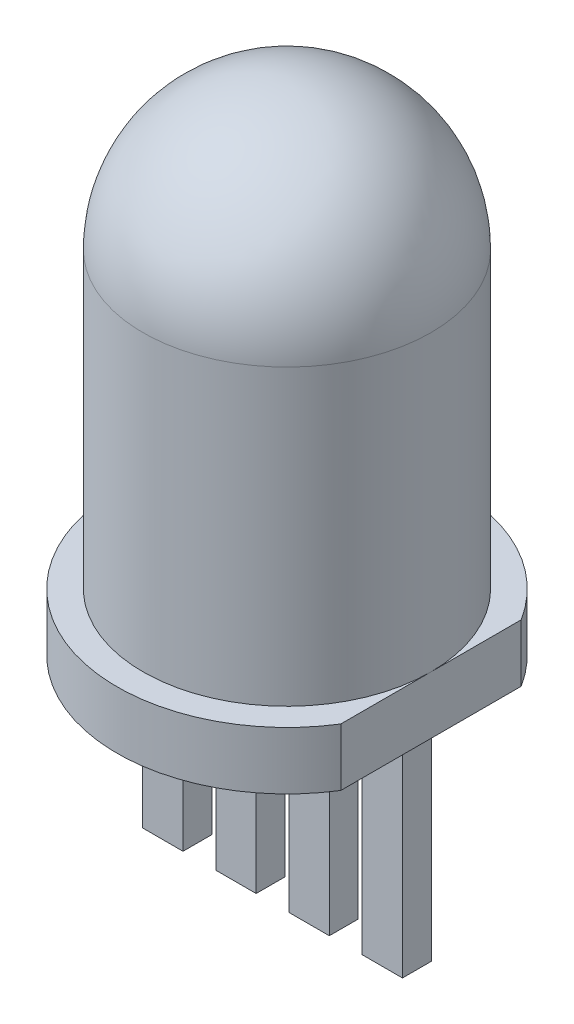
ISO-10303-21;
HEADER;
FILE_DESCRIPTION(('STEP AP214'),'2;1');
FILE_NAME('part.step','',(''),(''),'','','');
FILE_SCHEMA(('AUTOMOTIVE_DESIGN { 1 0 10303 214 1 1 1 1 }'));
ENDSEC;
DATA;
#1=APPLICATION_CONTEXT('core data for automotive mechanical design processes');
#2=APPLICATION_PROTOCOL_DEFINITION('international standard','automotive_design',2000,#1);
#3=PRODUCT_CONTEXT('',#1,'mechanical');
#4=PRODUCT('Part','Part','',(#3));
#5=PRODUCT_RELATED_PRODUCT_CATEGORY('part','',(#4));
#6=PRODUCT_DEFINITION_FORMATION('','',#4);
#7=PRODUCT_DEFINITION_CONTEXT('part definition',#1,'design');
#8=PRODUCT_DEFINITION('design','',#6,#7);
#9=PRODUCT_DEFINITION_SHAPE('','',#8);
#10=(LENGTH_UNIT() NAMED_UNIT(*) SI_UNIT(.MILLI.,.METRE.));
#11=(NAMED_UNIT(*) PLANE_ANGLE_UNIT() SI_UNIT($,.RADIAN.));
#12=(NAMED_UNIT(*) SI_UNIT($,.STERADIAN.) SOLID_ANGLE_UNIT());
#13=UNCERTAINTY_MEASURE_WITH_UNIT(LENGTH_MEASURE(1.E-05),#10,'distance_accuracy_value','');
#14=(GEOMETRIC_REPRESENTATION_CONTEXT(3) GLOBAL_UNCERTAINTY_ASSIGNED_CONTEXT((#13)) GLOBAL_UNIT_ASSIGNED_CONTEXT((#10,
#11,#12)) REPRESENTATION_CONTEXT('',''));
#15=CARTESIAN_POINT('',(0.,0.,0.));
#16=DIRECTION('',(0.,0.,1.));
#17=DIRECTION('',(1.,0.,0.));
#18=AXIS2_PLACEMENT_3D('',#15,#16,#17);
#19=CARTESIAN_POINT('',(0.,0.,0.));
#20=DIRECTION('',(0.,-1.,0.));
#21=DIRECTION('',(0.,0.,-1.));
#22=AXIS2_PLACEMENT_3D('',#19,#20,#21);
#23=CYLINDRICAL_SURFACE('',#22,2.5);
#24=CARTESIAN_POINT('',(0.,1.,0.));
#25=DIRECTION('',(0.,-1.,0.));
#26=DIRECTION('',(0.,0.,-1.));
#27=AXIS2_PLACEMENT_3D('',#24,#25,#26);
#28=CIRCLE('',#27,2.5);
#29=CARTESIAN_POINT('',(2.5,1.,0.));
#30=VERTEX_POINT('',#29);
#31=EDGE_CURVE('E24',#30,#30,#28,.T.);
#32=ORIENTED_EDGE('',*,*,#31,.F.);
#33=EDGE_LOOP('',(#32));
#34=FACE_BOUND('',#33,.T.);
#35=CARTESIAN_POINT('',(0.,6.1,0.));
#36=DIRECTION('',(0.,-1.,0.));
#37=DIRECTION('',(0.,0.,-1.));
#38=AXIS2_PLACEMENT_3D('',#35,#36,#37);
#39=CIRCLE('',#38,2.5);
#40=CARTESIAN_POINT('',(2.5,6.1,0.));
#41=VERTEX_POINT('',#40);
#42=CARTESIAN_POINT('',(-2.5,6.1,0.));
#43=VERTEX_POINT('',#42);
#44=EDGE_CURVE('E301',#41,#43,#39,.T.);
#45=ORIENTED_EDGE('',*,*,#44,.T.);
#46=CARTESIAN_POINT('',(0.,6.1,0.));
#47=DIRECTION('',(0.,-1.,0.));
#48=DIRECTION('',(0.,0.,-1.));
#49=AXIS2_PLACEMENT_3D('',#46,#47,#48);
#50=CIRCLE('',#49,2.5);
#51=EDGE_CURVE('E298',#43,#41,#50,.T.);
#52=ORIENTED_EDGE('',*,*,#51,.T.);
#53=EDGE_LOOP('',(#45,#52));
#54=FACE_BOUND('',#53,.T.);
#55=ADVANCED_FACE('F14',(#34,#54),#23,.T.);
#56=CARTESIAN_POINT('',(0.,6.1,0.));
#57=DIRECTION('',(1.,0.,0.));
#58=DIRECTION('',(0.,1.,0.));
#59=AXIS2_PLACEMENT_3D('',#56,#57,#58);
#60=SPHERICAL_SURFACE('',#59,2.5);
#61=ORIENTED_EDGE('',*,*,#51,.F.);
#62=ORIENTED_EDGE('',*,*,#44,.F.);
#63=EDGE_LOOP('',(#61,#62));
#64=FACE_BOUND('',#63,.T.);
#65=ADVANCED_FACE('F16',(#64),#60,.T.);
#66=CARTESIAN_POINT('',(2.5,1.,1.56604597633658));
#67=DIRECTION('',(-1.,0.,0.));
#68=DIRECTION('',(0.,0.,1.));
#69=AXIS2_PLACEMENT_3D('',#66,#67,#68);
#70=PLANE('',#69);
#71=DIRECTION('',(0.,1.,0.));
#72=VECTOR('',#71,1.);
#73=CARTESIAN_POINT('',(2.5,1.,-1.56604597633658));
#74=LINE('',#73,#72);
#75=CARTESIAN_POINT('',(2.5,1.,-1.56604597633658));
#76=VERTEX_POINT('',#75);
#77=CARTESIAN_POINT('',(2.5,0.,-1.56604597633658));
#78=VERTEX_POINT('',#77);
#79=EDGE_CURVE('E156',#76,#78,#74,.F.);
#80=ORIENTED_EDGE('',*,*,#79,.F.);
#81=CARTESIAN_POINT('',(2.5,1.,-1.56604597633658));
#82=CARTESIAN_POINT('',(2.5,1.,1.56604597633658));
#83=B_SPLINE_CURVE_WITH_KNOTS('',1,(#81,#82),.UNSPECIFIED.,.F.,.F.,(2,2),(0.,1.),.UNSPECIFIED.);
#84=EDGE_CURVE('E9',#76,#30,#83,.T.);
#85=ORIENTED_EDGE('',*,*,#84,.T.);
#86=CARTESIAN_POINT('',(2.5,1.,1.56604597633658));
#87=VERTEX_POINT('',#86);
#88=EDGE_CURVE('E26',#30,#87,#83,.T.);
#89=ORIENTED_EDGE('',*,*,#88,.T.);
#90=DIRECTION('',(0.,1.,0.));
#91=VECTOR('',#90,1.);
#92=CARTESIAN_POINT('',(2.5,1.,1.56604597633658));
#93=LINE('',#92,#91);
#94=CARTESIAN_POINT('',(2.5,0.,1.56604597633658));
#95=VERTEX_POINT('',#94);
#96=EDGE_CURVE('E149',#95,#87,#93,.T.);
#97=ORIENTED_EDGE('',*,*,#96,.F.);
#98=DIRECTION('',(0.,0.,1.));
#99=VECTOR('',#98,1.);
#100=CARTESIAN_POINT('',(2.5,0.,1.56604597633658));
#101=LINE('',#100,#99);
#102=EDGE_CURVE('E152',#78,#95,#101,.T.);
#103=ORIENTED_EDGE('',*,*,#102,.F.);
#104=EDGE_LOOP('',(#80,#85,#89,#97,#103));
#105=FACE_BOUND('',#104,.T.);
#106=ADVANCED_FACE('F151',(#105),#70,.F.);
#107=CARTESIAN_POINT('',(0.,0.,0.));
#108=DIRECTION('',(0.,-1.,0.));
#109=DIRECTION('',(0.,0.,-1.));
#110=AXIS2_PLACEMENT_3D('',#107,#108,#109);
#111=CYLINDRICAL_SURFACE('',#110,2.95);
#112=CARTESIAN_POINT('',(0.,0.,0.));
#113=DIRECTION('',(0.,-1.,0.));
#114=DIRECTION('',(0.,0.,-1.));
#115=AXIS2_PLACEMENT_3D('',#112,#113,#114);
#116=CIRCLE('',#115,2.95);
#117=EDGE_CURVE('E161',#78,#95,#116,.F.);
#118=ORIENTED_EDGE('',*,*,#117,.T.);
#119=ORIENTED_EDGE('',*,*,#96,.T.);
#120=CARTESIAN_POINT('',(0.,1.,0.));
#121=DIRECTION('',(0.,-1.,0.));
#122=DIRECTION('',(0.,0.,-1.));
#123=AXIS2_PLACEMENT_3D('',#120,#121,#122);
#124=CIRCLE('',#123,2.95);
#125=EDGE_CURVE('E19',#87,#76,#124,.T.);
#126=ORIENTED_EDGE('',*,*,#125,.T.);
#127=ORIENTED_EDGE('',*,*,#79,.T.);
#128=EDGE_LOOP('',(#118,#119,#126,#127));
#129=FACE_BOUND('',#128,.T.);
#130=ADVANCED_FACE('F163',(#129),#111,.T.);
#131=CARTESIAN_POINT('',(2.95,0.,0.));
#132=DIRECTION('',(0.,-1.,0.));
#133=DIRECTION('',(0.,0.,-1.));
#134=AXIS2_PLACEMENT_3D('',#131,#132,#133);
#135=PLANE('',#134);
#136=DIRECTION('',(1.,0.,0.));
#137=VECTOR('',#136,1.);
#138=CARTESIAN_POINT('',(2.95,0.,-0.25));
#139=LINE('',#138,#137);
#140=CARTESIAN_POINT('',(2.255,0.,-0.25));
#141=VERTEX_POINT('',#140);
#142=CARTESIAN_POINT('',(1.555,0.,-0.25));
#143=VERTEX_POINT('',#142);
#144=EDGE_CURVE('E164',#141,#143,#139,.F.);
#145=ORIENTED_EDGE('',*,*,#144,.T.);
#146=DIRECTION('',(0.,0.,-1.));
#147=VECTOR('',#146,1.);
#148=CARTESIAN_POINT('',(1.555,0.,0.));
#149=LINE('',#148,#147);
#150=CARTESIAN_POINT('',(1.555,0.,0.25));
#151=VERTEX_POINT('',#150);
#152=EDGE_CURVE('E166',#143,#151,#149,.F.);
#153=ORIENTED_EDGE('',*,*,#152,.T.);
#154=DIRECTION('',(1.,0.,0.));
#155=VECTOR('',#154,1.);
#156=CARTESIAN_POINT('',(2.95,0.,0.25));
#157=LINE('',#156,#155);
#158=CARTESIAN_POINT('',(2.255,0.,0.25));
#159=VERTEX_POINT('',#158);
#160=EDGE_CURVE('E170',#151,#159,#157,.T.);
#161=ORIENTED_EDGE('',*,*,#160,.T.);
#162=DIRECTION('',(0.,0.,-1.));
#163=VECTOR('',#162,1.);
#164=CARTESIAN_POINT('',(2.255,0.,0.));
#165=LINE('',#164,#163);
#166=EDGE_CURVE('E172',#159,#141,#165,.T.);
#167=ORIENTED_EDGE('',*,*,#166,.T.);
#168=EDGE_LOOP('',(#145,#153,#161,#167));
#169=FACE_BOUND('',#168,.T.);
#170=DIRECTION('',(1.,0.,0.));
#171=VECTOR('',#170,1.);
#172=CARTESIAN_POINT('',(2.95,0.,-0.25));
#173=LINE('',#172,#171);
#174=CARTESIAN_POINT('',(-0.284999999999999,0.,-0.25));
#175=VERTEX_POINT('',#174);
#176=CARTESIAN_POINT('',(-0.985,0.,-0.25));
#177=VERTEX_POINT('',#176);
#178=EDGE_CURVE('E175',#175,#177,#173,.F.);
#179=ORIENTED_EDGE('',*,*,#178,.T.);
#180=DIRECTION('',(0.,0.,-1.));
#181=VECTOR('',#180,1.);
#182=CARTESIAN_POINT('',(-0.985,0.,0.));
#183=LINE('',#182,#181);
#184=CARTESIAN_POINT('',(-0.985,0.,0.25));
#185=VERTEX_POINT('',#184);
#186=EDGE_CURVE('E177',#177,#185,#183,.F.);
#187=ORIENTED_EDGE('',*,*,#186,.T.);
#188=DIRECTION('',(1.,0.,0.));
#189=VECTOR('',#188,1.);
#190=CARTESIAN_POINT('',(2.95,0.,0.25));
#191=LINE('',#190,#189);
#192=CARTESIAN_POINT('',(-0.284999999999999,0.,0.25));
#193=VERTEX_POINT('',#192);
#194=EDGE_CURVE('E179',#185,#193,#191,.T.);
#195=ORIENTED_EDGE('',*,*,#194,.T.);
#196=DIRECTION('',(0.,0.,-1.));
#197=VECTOR('',#196,1.);
#198=CARTESIAN_POINT('',(-0.285,0.,0.));
#199=LINE('',#198,#197);
#200=EDGE_CURVE('E181',#193,#175,#199,.T.);
#201=ORIENTED_EDGE('',*,*,#200,.T.);
#202=EDGE_LOOP('',(#179,#187,#195,#201));
#203=FACE_BOUND('',#202,.T.);
#204=ORIENTED_EDGE('',*,*,#117,.F.);
#205=ORIENTED_EDGE('',*,*,#102,.T.);
#206=EDGE_LOOP('',(#204,#205));
#207=FACE_BOUND('',#206,.T.);
#208=DIRECTION('',(1.,0.,0.));
#209=VECTOR('',#208,1.);
#210=CARTESIAN_POINT('',(2.95,0.,-0.25));
#211=LINE('',#210,#209);
#212=CARTESIAN_POINT('',(-1.555,0.,-0.25));
#213=VERTEX_POINT('',#212);
#214=CARTESIAN_POINT('',(-2.255,0.,-0.25));
#215=VERTEX_POINT('',#214);
#216=EDGE_CURVE('E184',#213,#215,#211,.F.);
#217=ORIENTED_EDGE('',*,*,#216,.T.);
#218=DIRECTION('',(0.,0.,-1.));
#219=VECTOR('',#218,1.);
#220=CARTESIAN_POINT('',(-2.255,0.,0.));
#221=LINE('',#220,#219);
#222=CARTESIAN_POINT('',(-2.255,0.,0.25));
#223=VERTEX_POINT('',#222);
#224=EDGE_CURVE('E186',#215,#223,#221,.F.);
#225=ORIENTED_EDGE('',*,*,#224,.T.);
#226=DIRECTION('',(1.,0.,0.));
#227=VECTOR('',#226,1.);
#228=CARTESIAN_POINT('',(2.95,0.,0.25));
#229=LINE('',#228,#227);
#230=CARTESIAN_POINT('',(-1.555,0.,0.25));
#231=VERTEX_POINT('',#230);
#232=EDGE_CURVE('E188',#223,#231,#229,.T.);
#233=ORIENTED_EDGE('',*,*,#232,.T.);
#234=DIRECTION('',(0.,0.,-1.));
#235=VECTOR('',#234,1.);
#236=CARTESIAN_POINT('',(-1.555,0.,0.));
#237=LINE('',#236,#235);
#238=EDGE_CURVE('E190',#231,#213,#237,.T.);
#239=ORIENTED_EDGE('',*,*,#238,.T.);
#240=EDGE_LOOP('',(#217,#225,#233,#239));
#241=FACE_BOUND('',#240,.T.);
#242=DIRECTION('',(1.,0.,0.));
#243=VECTOR('',#242,1.);
#244=CARTESIAN_POINT('',(2.95,0.,-0.25));
#245=LINE('',#244,#243);
#246=CARTESIAN_POINT('',(0.985000000000001,0.,-0.25));
#247=VERTEX_POINT('',#246);
#248=CARTESIAN_POINT('',(0.285000000000001,0.,-0.25));
#249=VERTEX_POINT('',#248);
#250=EDGE_CURVE('E193',#247,#249,#245,.F.);
#251=ORIENTED_EDGE('',*,*,#250,.T.);
#252=DIRECTION('',(0.,0.,-1.));
#253=VECTOR('',#252,1.);
#254=CARTESIAN_POINT('',(0.285000000000001,0.,0.));
#255=LINE('',#254,#253);
#256=CARTESIAN_POINT('',(0.285000000000001,0.,0.25));
#257=VERTEX_POINT('',#256);
#258=EDGE_CURVE('E195',#249,#257,#255,.F.);
#259=ORIENTED_EDGE('',*,*,#258,.T.);
#260=DIRECTION('',(1.,0.,0.));
#261=VECTOR('',#260,1.);
#262=CARTESIAN_POINT('',(2.95,0.,0.25));
#263=LINE('',#262,#261);
#264=CARTESIAN_POINT('',(0.985000000000001,0.,0.25));
#265=VERTEX_POINT('',#264);
#266=EDGE_CURVE('E197',#257,#265,#263,.T.);
#267=ORIENTED_EDGE('',*,*,#266,.T.);
#268=DIRECTION('',(0.,0.,-1.));
#269=VECTOR('',#268,1.);
#270=CARTESIAN_POINT('',(0.985000000000001,0.,0.));
#271=LINE('',#270,#269);
#272=EDGE_CURVE('E199',#265,#247,#271,.T.);
#273=ORIENTED_EDGE('',*,*,#272,.T.);
#274=EDGE_LOOP('',(#251,#259,#267,#273));
#275=FACE_BOUND('',#274,.T.);
#276=ADVANCED_FACE('F159',(#169,#203,#207,#241,#275),#135,.T.);
#277=CARTESIAN_POINT('',(1.555,-3.6,-0.25));
#278=DIRECTION('',(0.,0.,1.));
#279=DIRECTION('',(1.,0.,0.));
#280=AXIS2_PLACEMENT_3D('',#277,#278,#279);
#281=PLANE('',#280);
#282=DIRECTION('',(0.,1.,0.));
#283=VECTOR('',#282,1.);
#284=CARTESIAN_POINT('',(2.255,-3.6,-0.25));
#285=LINE('',#284,#283);
#286=CARTESIAN_POINT('',(2.255,-3.6,-0.25));
#287=VERTEX_POINT('',#286);
#288=EDGE_CURVE('E202',#287,#141,#285,.T.);
#289=ORIENTED_EDGE('',*,*,#288,.F.);
#290=DIRECTION('',(1.,0.,0.));
#291=VECTOR('',#290,1.);
#292=CARTESIAN_POINT('',(1.555,-3.6,-0.25));
#293=LINE('',#292,#291);
#294=CARTESIAN_POINT('',(1.555,-3.6,-0.25));
#295=VERTEX_POINT('',#294);
#296=EDGE_CURVE('E205',#295,#287,#293,.T.);
#297=ORIENTED_EDGE('',*,*,#296,.F.);
#298=DIRECTION('',(0.,1.,0.));
#299=VECTOR('',#298,1.);
#300=CARTESIAN_POINT('',(1.555,-3.6,-0.25));
#301=LINE('',#300,#299);
#302=EDGE_CURVE('E208',#295,#143,#301,.T.);
#303=ORIENTED_EDGE('',*,*,#302,.T.);
#304=ORIENTED_EDGE('',*,*,#144,.F.);
#305=EDGE_LOOP('',(#289,#297,#303,#304));
#306=FACE_BOUND('',#305,.T.);
#307=ADVANCED_FACE('F330',(#306),#281,.F.);
#308=CARTESIAN_POINT('',(1.555,-3.6,-0.25));
#309=DIRECTION('',(1.,0.,0.));
#310=DIRECTION('',(0.,0.,-1.));
#311=AXIS2_PLACEMENT_3D('',#308,#309,#310);
#312=PLANE('',#311);
#313=ORIENTED_EDGE('',*,*,#302,.F.);
#314=DIRECTION('',(0.,0.,-1.));
#315=VECTOR('',#314,1.);
#316=CARTESIAN_POINT('',(1.555,-3.6,-0.25));
#317=LINE('',#316,#315);
#318=CARTESIAN_POINT('',(1.555,-3.6,0.25));
#319=VERTEX_POINT('',#318);
#320=EDGE_CURVE('E211',#319,#295,#317,.T.);
#321=ORIENTED_EDGE('',*,*,#320,.F.);
#322=DIRECTION('',(0.,1.,0.));
#323=VECTOR('',#322,1.);
#324=CARTESIAN_POINT('',(1.555,-3.6,0.25));
#325=LINE('',#324,#323);
#326=EDGE_CURVE('E214',#151,#319,#325,.F.);
#327=ORIENTED_EDGE('',*,*,#326,.F.);
#328=ORIENTED_EDGE('',*,*,#152,.F.);
#329=EDGE_LOOP('',(#313,#321,#327,#328));
#330=FACE_BOUND('',#329,.T.);
#331=ADVANCED_FACE('F334',(#330),#312,.F.);
#332=CARTESIAN_POINT('',(1.555,-3.6,0.25));
#333=DIRECTION('',(0.,0.,-1.));
#334=DIRECTION('',(-1.,0.,0.));
#335=AXIS2_PLACEMENT_3D('',#332,#333,#334);
#336=PLANE('',#335);
#337=ORIENTED_EDGE('',*,*,#326,.T.);
#338=DIRECTION('',(-1.,0.,0.));
#339=VECTOR('',#338,1.);
#340=CARTESIAN_POINT('',(1.555,-3.6,0.25));
#341=LINE('',#340,#339);
#342=CARTESIAN_POINT('',(2.255,-3.6,0.25));
#343=VERTEX_POINT('',#342);
#344=EDGE_CURVE('E217',#343,#319,#341,.T.);
#345=ORIENTED_EDGE('',*,*,#344,.F.);
#346=DIRECTION('',(0.,1.,0.));
#347=VECTOR('',#346,1.);
#348=CARTESIAN_POINT('',(2.255,-3.6,0.25));
#349=LINE('',#348,#347);
#350=EDGE_CURVE('E220',#343,#159,#349,.T.);
#351=ORIENTED_EDGE('',*,*,#350,.T.);
#352=ORIENTED_EDGE('',*,*,#160,.F.);
#353=EDGE_LOOP('',(#337,#345,#351,#352));
#354=FACE_BOUND('',#353,.T.);
#355=ADVANCED_FACE('F338',(#354),#336,.F.);
#356=CARTESIAN_POINT('',(2.255,-3.6,-0.25));
#357=DIRECTION('',(-1.,0.,0.));
#358=DIRECTION('',(0.,0.,1.));
#359=AXIS2_PLACEMENT_3D('',#356,#357,#358);
#360=PLANE('',#359);
#361=ORIENTED_EDGE('',*,*,#350,.F.);
#362=DIRECTION('',(0.,0.,1.));
#363=VECTOR('',#362,1.);
#364=CARTESIAN_POINT('',(2.255,-3.6,-0.25));
#365=LINE('',#364,#363);
#366=EDGE_CURVE('E223',#287,#343,#365,.T.);
#367=ORIENTED_EDGE('',*,*,#366,.F.);
#368=ORIENTED_EDGE('',*,*,#288,.T.);
#369=ORIENTED_EDGE('',*,*,#166,.F.);
#370=EDGE_LOOP('',(#361,#367,#368,#369));
#371=FACE_BOUND('',#370,.T.);
#372=ADVANCED_FACE('F342',(#371),#360,.F.);
#373=CARTESIAN_POINT('',(-0.985,-3.6,-0.25));
#374=DIRECTION('',(0.,0.,1.));
#375=DIRECTION('',(1.,0.,0.));
#376=AXIS2_PLACEMENT_3D('',#373,#374,#375);
#377=PLANE('',#376);
#378=DIRECTION('',(0.,1.,0.));
#379=VECTOR('',#378,1.);
#380=CARTESIAN_POINT('',(-0.284999999999999,-3.6,-0.25));
#381=LINE('',#380,#379);
#382=CARTESIAN_POINT('',(-0.284999999999999,-3.6,-0.25));
#383=VERTEX_POINT('',#382);
#384=EDGE_CURVE('E226',#383,#175,#381,.T.);
#385=ORIENTED_EDGE('',*,*,#384,.F.);
#386=DIRECTION('',(1.,0.,0.));
#387=VECTOR('',#386,1.);
#388=CARTESIAN_POINT('',(-0.985,-3.6,-0.25));
#389=LINE('',#388,#387);
#390=CARTESIAN_POINT('',(-0.985,-3.6,-0.25));
#391=VERTEX_POINT('',#390);
#392=EDGE_CURVE('E229',#391,#383,#389,.T.);
#393=ORIENTED_EDGE('',*,*,#392,.F.);
#394=DIRECTION('',(0.,1.,0.));
#395=VECTOR('',#394,1.);
#396=CARTESIAN_POINT('',(-0.985,-3.6,-0.25));
#397=LINE('',#396,#395);
#398=EDGE_CURVE('E232',#391,#177,#397,.T.);
#399=ORIENTED_EDGE('',*,*,#398,.T.);
#400=ORIENTED_EDGE('',*,*,#178,.F.);
#401=EDGE_LOOP('',(#385,#393,#399,#400));
#402=FACE_BOUND('',#401,.T.);
#403=ADVANCED_FACE('F346',(#402),#377,.F.);
#404=CARTESIAN_POINT('',(-0.985,-3.6,-0.25));
#405=DIRECTION('',(1.,0.,0.));
#406=DIRECTION('',(0.,0.,-1.));
#407=AXIS2_PLACEMENT_3D('',#404,#405,#406);
#408=PLANE('',#407);
#409=ORIENTED_EDGE('',*,*,#398,.F.);
#410=DIRECTION('',(0.,0.,-1.));
#411=VECTOR('',#410,1.);
#412=CARTESIAN_POINT('',(-0.985,-3.6,-0.25));
#413=LINE('',#412,#411);
#414=CARTESIAN_POINT('',(-0.985,-3.6,0.25));
#415=VERTEX_POINT('',#414);
#416=EDGE_CURVE('E235',#415,#391,#413,.T.);
#417=ORIENTED_EDGE('',*,*,#416,.F.);
#418=DIRECTION('',(0.,1.,0.));
#419=VECTOR('',#418,1.);
#420=CARTESIAN_POINT('',(-0.985,-3.6,0.25));
#421=LINE('',#420,#419);
#422=EDGE_CURVE('E238',#185,#415,#421,.F.);
#423=ORIENTED_EDGE('',*,*,#422,.F.);
#424=ORIENTED_EDGE('',*,*,#186,.F.);
#425=EDGE_LOOP('',(#409,#417,#423,#424));
#426=FACE_BOUND('',#425,.T.);
#427=ADVANCED_FACE('F350',(#426),#408,.F.);
#428=CARTESIAN_POINT('',(-0.985,-3.6,0.25));
#429=DIRECTION('',(0.,0.,-1.));
#430=DIRECTION('',(-1.,0.,0.));
#431=AXIS2_PLACEMENT_3D('',#428,#429,#430);
#432=PLANE('',#431);
#433=ORIENTED_EDGE('',*,*,#422,.T.);
#434=DIRECTION('',(-1.,0.,0.));
#435=VECTOR('',#434,1.);
#436=CARTESIAN_POINT('',(-0.985,-3.6,0.25));
#437=LINE('',#436,#435);
#438=CARTESIAN_POINT('',(-0.284999999999999,-3.6,0.25));
#439=VERTEX_POINT('',#438);
#440=EDGE_CURVE('E241',#439,#415,#437,.T.);
#441=ORIENTED_EDGE('',*,*,#440,.F.);
#442=DIRECTION('',(0.,1.,0.));
#443=VECTOR('',#442,1.);
#444=CARTESIAN_POINT('',(-0.284999999999999,-3.6,0.25));
#445=LINE('',#444,#443);
#446=EDGE_CURVE('E244',#439,#193,#445,.T.);
#447=ORIENTED_EDGE('',*,*,#446,.T.);
#448=ORIENTED_EDGE('',*,*,#194,.F.);
#449=EDGE_LOOP('',(#433,#441,#447,#448));
#450=FACE_BOUND('',#449,.T.);
#451=ADVANCED_FACE('F354',(#450),#432,.F.);
#452=CARTESIAN_POINT('',(-0.284999999999999,-3.6,-0.25));
#453=DIRECTION('',(-1.,0.,0.));
#454=DIRECTION('',(0.,0.,1.));
#455=AXIS2_PLACEMENT_3D('',#452,#453,#454);
#456=PLANE('',#455);
#457=ORIENTED_EDGE('',*,*,#446,.F.);
#458=DIRECTION('',(0.,0.,1.));
#459=VECTOR('',#458,1.);
#460=CARTESIAN_POINT('',(-0.284999999999999,-3.6,-0.25));
#461=LINE('',#460,#459);
#462=EDGE_CURVE('E247',#383,#439,#461,.T.);
#463=ORIENTED_EDGE('',*,*,#462,.F.);
#464=ORIENTED_EDGE('',*,*,#384,.T.);
#465=ORIENTED_EDGE('',*,*,#200,.F.);
#466=EDGE_LOOP('',(#457,#463,#464,#465));
#467=FACE_BOUND('',#466,.T.);
#468=ADVANCED_FACE('F358',(#467),#456,.F.);
#469=CARTESIAN_POINT('',(-2.255,-3.6,-0.25));
#470=DIRECTION('',(0.,0.,1.));
#471=DIRECTION('',(1.,0.,0.));
#472=AXIS2_PLACEMENT_3D('',#469,#470,#471);
#473=PLANE('',#472);
#474=DIRECTION('',(0.,1.,0.));
#475=VECTOR('',#474,1.);
#476=CARTESIAN_POINT('',(-1.555,-3.6,-0.25));
#477=LINE('',#476,#475);
#478=CARTESIAN_POINT('',(-1.555,-3.6,-0.25));
#479=VERTEX_POINT('',#478);
#480=EDGE_CURVE('E250',#479,#213,#477,.T.);
#481=ORIENTED_EDGE('',*,*,#480,.F.);
#482=DIRECTION('',(1.,0.,0.));
#483=VECTOR('',#482,1.);
#484=CARTESIAN_POINT('',(-2.255,-3.6,-0.25));
#485=LINE('',#484,#483);
#486=CARTESIAN_POINT('',(-2.255,-3.6,-0.25));
#487=VERTEX_POINT('',#486);
#488=EDGE_CURVE('E253',#487,#479,#485,.T.);
#489=ORIENTED_EDGE('',*,*,#488,.F.);
#490=DIRECTION('',(0.,1.,0.));
#491=VECTOR('',#490,1.);
#492=CARTESIAN_POINT('',(-2.255,-3.6,-0.25));
#493=LINE('',#492,#491);
#494=EDGE_CURVE('E256',#487,#215,#493,.T.);
#495=ORIENTED_EDGE('',*,*,#494,.T.);
#496=ORIENTED_EDGE('',*,*,#216,.F.);
#497=EDGE_LOOP('',(#481,#489,#495,#496));
#498=FACE_BOUND('',#497,.T.);
#499=ADVANCED_FACE('F362',(#498),#473,.F.);
#500=CARTESIAN_POINT('',(-2.255,-3.6,-0.25));
#501=DIRECTION('',(1.,0.,0.));
#502=DIRECTION('',(0.,0.,-1.));
#503=AXIS2_PLACEMENT_3D('',#500,#501,#502);
#504=PLANE('',#503);
#505=ORIENTED_EDGE('',*,*,#494,.F.);
#506=DIRECTION('',(0.,0.,-1.));
#507=VECTOR('',#506,1.);
#508=CARTESIAN_POINT('',(-2.255,-3.6,-0.25));
#509=LINE('',#508,#507);
#510=CARTESIAN_POINT('',(-2.255,-3.6,0.25));
#511=VERTEX_POINT('',#510);
#512=EDGE_CURVE('E259',#511,#487,#509,.T.);
#513=ORIENTED_EDGE('',*,*,#512,.F.);
#514=DIRECTION('',(0.,1.,0.));
#515=VECTOR('',#514,1.);
#516=CARTESIAN_POINT('',(-2.255,-3.6,0.25));
#517=LINE('',#516,#515);
#518=EDGE_CURVE('E262',#223,#511,#517,.F.);
#519=ORIENTED_EDGE('',*,*,#518,.F.);
#520=ORIENTED_EDGE('',*,*,#224,.F.);
#521=EDGE_LOOP('',(#505,#513,#519,#520));
#522=FACE_BOUND('',#521,.T.);
#523=ADVANCED_FACE('F366',(#522),#504,.F.);
#524=CARTESIAN_POINT('',(-2.255,-3.6,0.25));
#525=DIRECTION('',(0.,0.,-1.));
#526=DIRECTION('',(-1.,0.,0.));
#527=AXIS2_PLACEMENT_3D('',#524,#525,#526);
#528=PLANE('',#527);
#529=ORIENTED_EDGE('',*,*,#518,.T.);
#530=DIRECTION('',(-1.,0.,0.));
#531=VECTOR('',#530,1.);
#532=CARTESIAN_POINT('',(-2.255,-3.6,0.25));
#533=LINE('',#532,#531);
#534=CARTESIAN_POINT('',(-1.555,-3.6,0.25));
#535=VERTEX_POINT('',#534);
#536=EDGE_CURVE('E265',#535,#511,#533,.T.);
#537=ORIENTED_EDGE('',*,*,#536,.F.);
#538=DIRECTION('',(0.,1.,0.));
#539=VECTOR('',#538,1.);
#540=CARTESIAN_POINT('',(-1.555,-3.6,0.25));
#541=LINE('',#540,#539);
#542=EDGE_CURVE('E268',#535,#231,#541,.T.);
#543=ORIENTED_EDGE('',*,*,#542,.T.);
#544=ORIENTED_EDGE('',*,*,#232,.F.);
#545=EDGE_LOOP('',(#529,#537,#543,#544));
#546=FACE_BOUND('',#545,.T.);
#547=ADVANCED_FACE('F370',(#546),#528,.F.);
#548=CARTESIAN_POINT('',(-1.555,-3.6,-0.25));
#549=DIRECTION('',(-1.,0.,0.));
#550=DIRECTION('',(0.,0.,1.));
#551=AXIS2_PLACEMENT_3D('',#548,#549,#550);
#552=PLANE('',#551);
#553=ORIENTED_EDGE('',*,*,#542,.F.);
#554=DIRECTION('',(0.,0.,1.));
#555=VECTOR('',#554,1.);
#556=CARTESIAN_POINT('',(-1.555,-3.6,-0.25));
#557=LINE('',#556,#555);
#558=EDGE_CURVE('E271',#479,#535,#557,.T.);
#559=ORIENTED_EDGE('',*,*,#558,.F.);
#560=ORIENTED_EDGE('',*,*,#480,.T.);
#561=ORIENTED_EDGE('',*,*,#238,.F.);
#562=EDGE_LOOP('',(#553,#559,#560,#561));
#563=FACE_BOUND('',#562,.T.);
#564=ADVANCED_FACE('F374',(#563),#552,.F.);
#565=CARTESIAN_POINT('',(0.285000000000001,-3.6,-0.25));
#566=DIRECTION('',(0.,0.,1.));
#567=DIRECTION('',(1.,0.,0.));
#568=AXIS2_PLACEMENT_3D('',#565,#566,#567);
#569=PLANE('',#568);
#570=DIRECTION('',(0.,1.,0.));
#571=VECTOR('',#570,1.);
#572=CARTESIAN_POINT('',(0.985000000000001,-3.6,-0.25));
#573=LINE('',#572,#571);
#574=CARTESIAN_POINT('',(0.985000000000001,-3.6,-0.25));
#575=VERTEX_POINT('',#574);
#576=EDGE_CURVE('E274',#575,#247,#573,.T.);
#577=ORIENTED_EDGE('',*,*,#576,.F.);
#578=DIRECTION('',(1.,0.,0.));
#579=VECTOR('',#578,1.);
#580=CARTESIAN_POINT('',(0.285000000000001,-3.6,-0.25));
#581=LINE('',#580,#579);
#582=CARTESIAN_POINT('',(0.285000000000001,-3.6,-0.25));
#583=VERTEX_POINT('',#582);
#584=EDGE_CURVE('E277',#583,#575,#581,.T.);
#585=ORIENTED_EDGE('',*,*,#584,.F.);
#586=DIRECTION('',(0.,1.,0.));
#587=VECTOR('',#586,1.);
#588=CARTESIAN_POINT('',(0.285000000000001,-3.6,-0.25));
#589=LINE('',#588,#587);
#590=EDGE_CURVE('E280',#583,#249,#589,.T.);
#591=ORIENTED_EDGE('',*,*,#590,.T.);
#592=ORIENTED_EDGE('',*,*,#250,.F.);
#593=EDGE_LOOP('',(#577,#585,#591,#592));
#594=FACE_BOUND('',#593,.T.);
#595=ADVANCED_FACE('F378',(#594),#569,.F.);
#596=CARTESIAN_POINT('',(0.285000000000001,-3.6,-0.25));
#597=DIRECTION('',(1.,0.,0.));
#598=DIRECTION('',(0.,0.,-1.));
#599=AXIS2_PLACEMENT_3D('',#596,#597,#598);
#600=PLANE('',#599);
#601=ORIENTED_EDGE('',*,*,#590,.F.);
#602=DIRECTION('',(0.,0.,-1.));
#603=VECTOR('',#602,1.);
#604=CARTESIAN_POINT('',(0.285000000000001,-3.6,-0.25));
#605=LINE('',#604,#603);
#606=CARTESIAN_POINT('',(0.285000000000001,-3.6,0.25));
#607=VERTEX_POINT('',#606);
#608=EDGE_CURVE('E283',#607,#583,#605,.T.);
#609=ORIENTED_EDGE('',*,*,#608,.F.);
#610=DIRECTION('',(0.,1.,0.));
#611=VECTOR('',#610,1.);
#612=CARTESIAN_POINT('',(0.285000000000001,-3.6,0.25));
#613=LINE('',#612,#611);
#614=EDGE_CURVE('E286',#257,#607,#613,.F.);
#615=ORIENTED_EDGE('',*,*,#614,.F.);
#616=ORIENTED_EDGE('',*,*,#258,.F.);
#617=EDGE_LOOP('',(#601,#609,#615,#616));
#618=FACE_BOUND('',#617,.T.);
#619=ADVANCED_FACE('F382',(#618),#600,.F.);
#620=CARTESIAN_POINT('',(0.285000000000001,-3.6,0.25));
#621=DIRECTION('',(0.,0.,-1.));
#622=DIRECTION('',(-1.,0.,0.));
#623=AXIS2_PLACEMENT_3D('',#620,#621,#622);
#624=PLANE('',#623);
#625=ORIENTED_EDGE('',*,*,#614,.T.);
#626=DIRECTION('',(-1.,0.,0.));
#627=VECTOR('',#626,1.);
#628=CARTESIAN_POINT('',(0.285000000000001,-3.6,0.25));
#629=LINE('',#628,#627);
#630=CARTESIAN_POINT('',(0.985000000000001,-3.6,0.25));
#631=VERTEX_POINT('',#630);
#632=EDGE_CURVE('E289',#631,#607,#629,.T.);
#633=ORIENTED_EDGE('',*,*,#632,.F.);
#634=DIRECTION('',(0.,1.,0.));
#635=VECTOR('',#634,1.);
#636=CARTESIAN_POINT('',(0.985000000000001,-3.6,0.25));
#637=LINE('',#636,#635);
#638=EDGE_CURVE('E292',#631,#265,#637,.T.);
#639=ORIENTED_EDGE('',*,*,#638,.T.);
#640=ORIENTED_EDGE('',*,*,#266,.F.);
#641=EDGE_LOOP('',(#625,#633,#639,#640));
#642=FACE_BOUND('',#641,.T.);
#643=ADVANCED_FACE('F386',(#642),#624,.F.);
#644=CARTESIAN_POINT('',(0.985000000000001,-3.6,-0.25));
#645=DIRECTION('',(-1.,0.,0.));
#646=DIRECTION('',(0.,0.,1.));
#647=AXIS2_PLACEMENT_3D('',#644,#645,#646);
#648=PLANE('',#647);
#649=ORIENTED_EDGE('',*,*,#638,.F.);
#650=DIRECTION('',(0.,0.,1.));
#651=VECTOR('',#650,1.);
#652=CARTESIAN_POINT('',(0.985000000000001,-3.6,-0.25));
#653=LINE('',#652,#651);
#654=EDGE_CURVE('E295',#575,#631,#653,.T.);
#655=ORIENTED_EDGE('',*,*,#654,.F.);
#656=ORIENTED_EDGE('',*,*,#576,.T.);
#657=ORIENTED_EDGE('',*,*,#272,.F.);
#658=EDGE_LOOP('',(#649,#655,#656,#657));
#659=FACE_BOUND('',#658,.T.);
#660=ADVANCED_FACE('F390',(#659),#648,.F.);
#661=CARTESIAN_POINT('',(2.54,-3.6,0.));
#662=DIRECTION('',(0.,1.,0.));
#663=DIRECTION('',(0.,0.,1.));
#664=AXIS2_PLACEMENT_3D('',#661,#662,#663);
#665=PLANE('',#664);
#666=ORIENTED_EDGE('',*,*,#632,.T.);
#667=ORIENTED_EDGE('',*,*,#608,.T.);
#668=ORIENTED_EDGE('',*,*,#584,.T.);
#669=ORIENTED_EDGE('',*,*,#654,.T.);
#670=EDGE_LOOP('',(#666,#667,#668,#669));
#671=FACE_BOUND('',#670,.T.);
#672=ADVANCED_FACE('F394',(#671),#665,.F.);
#673=CARTESIAN_POINT('',(0.,-3.6,0.));
#674=DIRECTION('',(0.,1.,0.));
#675=DIRECTION('',(0.,0.,1.));
#676=AXIS2_PLACEMENT_3D('',#673,#674,#675);
#677=PLANE('',#676);
#678=ORIENTED_EDGE('',*,*,#536,.T.);
#679=ORIENTED_EDGE('',*,*,#512,.T.);
#680=ORIENTED_EDGE('',*,*,#488,.T.);
#681=ORIENTED_EDGE('',*,*,#558,.T.);
#682=EDGE_LOOP('',(#678,#679,#680,#681));
#683=FACE_BOUND('',#682,.T.);
#684=ADVANCED_FACE('F398',(#683),#677,.F.);
#685=CARTESIAN_POINT('',(1.27,-3.6,0.));
#686=DIRECTION('',(0.,1.,0.));
#687=DIRECTION('',(0.,0.,1.));
#688=AXIS2_PLACEMENT_3D('',#685,#686,#687);
#689=PLANE('',#688);
#690=ORIENTED_EDGE('',*,*,#440,.T.);
#691=ORIENTED_EDGE('',*,*,#416,.T.);
#692=ORIENTED_EDGE('',*,*,#392,.T.);
#693=ORIENTED_EDGE('',*,*,#462,.T.);
#694=EDGE_LOOP('',(#690,#691,#692,#693));
#695=FACE_BOUND('',#694,.T.);
#696=ADVANCED_FACE('F320',(#695),#689,.F.);
#697=CARTESIAN_POINT('',(3.81,-3.6,0.));
#698=DIRECTION('',(0.,1.,0.));
#699=DIRECTION('',(0.,0.,1.));
#700=AXIS2_PLACEMENT_3D('',#697,#698,#699);
#701=PLANE('',#700);
#702=ORIENTED_EDGE('',*,*,#344,.T.);
#703=ORIENTED_EDGE('',*,*,#320,.T.);
#704=ORIENTED_EDGE('',*,*,#296,.T.);
#705=ORIENTED_EDGE('',*,*,#366,.T.);
#706=EDGE_LOOP('',(#702,#703,#704,#705));
#707=FACE_BOUND('',#706,.T.);
#708=ADVANCED_FACE('F313',(#707),#701,.F.);
#709=CARTESIAN_POINT('',(2.5,1.,0.));
#710=DIRECTION('',(0.,1.,0.));
#711=DIRECTION('',(0.,0.,1.));
#712=AXIS2_PLACEMENT_3D('',#709,#710,#711);
#713=PLANE('',#712);
#714=ORIENTED_EDGE('',*,*,#125,.F.);
#715=ORIENTED_EDGE('',*,*,#88,.F.);
#716=ORIENTED_EDGE('',*,*,#31,.T.);
#717=ORIENTED_EDGE('',*,*,#84,.F.);
#718=EDGE_LOOP('',(#714,#715,#716,#717));
#719=FACE_BOUND('',#718,.T.);
#720=ADVANCED_FACE('F311',(#719),#713,.T.);
#721=CLOSED_SHELL('',(#55,#65,#106,#130,#276,#307,#331,#355,#372,#403,#427,#451,#468,#499,#523,
#547,#564,#595,#619,#643,#660,#672,#684,#696,#708,#720));
#722=MANIFOLD_SOLID_BREP('B1',#721);
#723=ADVANCED_BREP_SHAPE_REPRESENTATION('',(#18,#722),#14);
#724=SHAPE_DEFINITION_REPRESENTATION(#9,#723);
ENDSEC;
END-ISO-10303-21;
